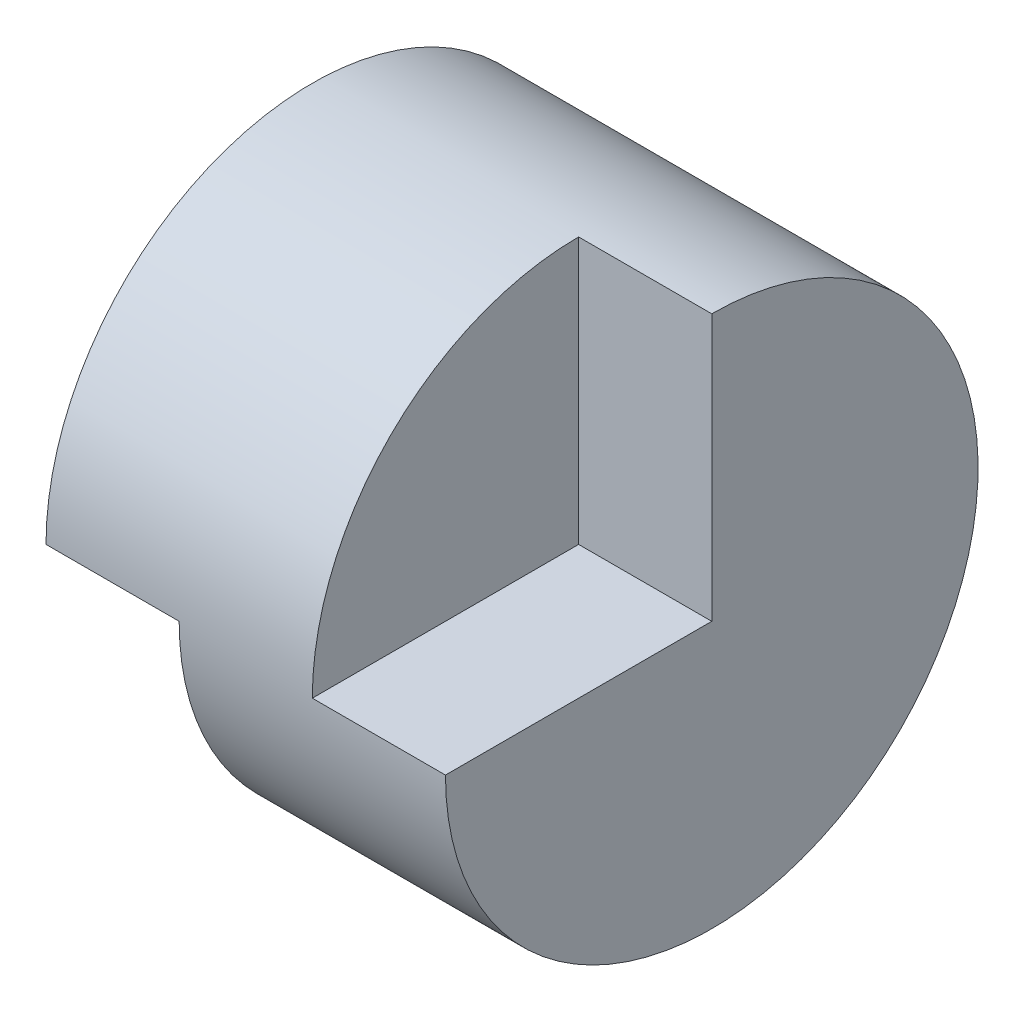
ISO-10303-21;
HEADER;
FILE_DESCRIPTION(('STEP AP214'),'2;1');
FILE_NAME('part.step','',(''),(''),'','','');
FILE_SCHEMA(('AUTOMOTIVE_DESIGN { 1 0 10303 214 1 1 1 1 }'));
ENDSEC;
DATA;
#1=APPLICATION_CONTEXT('core data for automotive mechanical design processes');
#2=APPLICATION_PROTOCOL_DEFINITION('international standard','automotive_design',2000,#1);
#3=PRODUCT_CONTEXT('',#1,'mechanical');
#4=PRODUCT('Part','Part','',(#3));
#5=PRODUCT_RELATED_PRODUCT_CATEGORY('part','',(#4));
#6=PRODUCT_DEFINITION_FORMATION('','',#4);
#7=PRODUCT_DEFINITION_CONTEXT('part definition',#1,'design');
#8=PRODUCT_DEFINITION('design','',#6,#7);
#9=PRODUCT_DEFINITION_SHAPE('','',#8);
#10=(LENGTH_UNIT() NAMED_UNIT(*) SI_UNIT(.MILLI.,.METRE.));
#11=(NAMED_UNIT(*) PLANE_ANGLE_UNIT() SI_UNIT($,.RADIAN.));
#12=(NAMED_UNIT(*) SI_UNIT($,.STERADIAN.) SOLID_ANGLE_UNIT());
#13=UNCERTAINTY_MEASURE_WITH_UNIT(LENGTH_MEASURE(1.E-05),#10,'distance_accuracy_value','');
#14=(GEOMETRIC_REPRESENTATION_CONTEXT(3) GLOBAL_UNCERTAINTY_ASSIGNED_CONTEXT((#13)) GLOBAL_UNIT_ASSIGNED_CONTEXT((#10,
#11,#12)) REPRESENTATION_CONTEXT('',''));
#15=CARTESIAN_POINT('',(0.,0.,0.));
#16=DIRECTION('',(0.,0.,1.));
#17=DIRECTION('',(1.,0.,0.));
#18=AXIS2_PLACEMENT_3D('',#15,#16,#17);
#19=CARTESIAN_POINT('',(40.,0.,40.));
#20=DIRECTION('',(-1.,0.,0.));
#21=DIRECTION('',(0.,0.,1.));
#22=AXIS2_PLACEMENT_3D('',#19,#20,#21);
#23=PLANE('',#22);
#24=CARTESIAN_POINT('',(40.,20.,20.));
#25=DIRECTION('',(-1.,0.,0.));
#26=DIRECTION('',(0.,0.,1.));
#27=AXIS2_PLACEMENT_3D('',#24,#25,#26);
#28=CIRCLE('',#27,20.);
#29=CARTESIAN_POINT('',(40.,40.,20.));
#30=VERTEX_POINT('',#29);
#31=CARTESIAN_POINT('',(40.,20.,40.));
#32=VERTEX_POINT('',#31);
#33=EDGE_CURVE('E181',#30,#32,#28,.T.);
#34=ORIENTED_EDGE('',*,*,#33,.F.);
#35=DIRECTION('',(0.,1.,0.));
#36=VECTOR('',#35,1.);
#37=CARTESIAN_POINT('',(40.,20.,20.));
#38=LINE('',#37,#36);
#39=CARTESIAN_POINT('',(40.,20.,20.));
#40=VERTEX_POINT('',#39);
#41=EDGE_CURVE('E159',#40,#30,#38,.T.);
#42=ORIENTED_EDGE('',*,*,#41,.F.);
#43=DIRECTION('',(0.,0.,-1.));
#44=VECTOR('',#43,1.);
#45=CARTESIAN_POINT('',(40.,20.,40.));
#46=LINE('',#45,#44);
#47=EDGE_CURVE('E162',#32,#40,#46,.T.);
#48=ORIENTED_EDGE('',*,*,#47,.F.);
#49=EDGE_LOOP('',(#34,#42,#48));
#50=FACE_BOUND('',#49,.T.);
#51=ADVANCED_FACE('F69',(#50),#23,.F.);
#52=CARTESIAN_POINT('',(10.,40.,0.));
#53=DIRECTION('',(1.,0.,0.));
#54=DIRECTION('',(0.,1.,0.));
#55=AXIS2_PLACEMENT_3D('',#52,#53,#54);
#56=PLANE('',#55);
#57=DIRECTION('',(0.,0.,1.));
#58=VECTOR('',#57,1.);
#59=CARTESIAN_POINT('',(10.,20.,0.));
#60=LINE('',#59,#58);
#61=CARTESIAN_POINT('',(10.,20.,0.));
#62=VERTEX_POINT('',#61);
#63=CARTESIAN_POINT('',(10.,20.,20.));
#64=VERTEX_POINT('',#63);
#65=EDGE_CURVE('E12',#62,#64,#60,.T.);
#66=ORIENTED_EDGE('',*,*,#65,.T.);
#67=DIRECTION('',(0.,0.,1.));
#68=VECTOR('',#67,1.);
#69=CARTESIAN_POINT('',(10.,20.,0.));
#70=LINE('',#69,#68);
#71=CARTESIAN_POINT('',(10.,20.,40.));
#72=VERTEX_POINT('',#71);
#73=EDGE_CURVE('E137',#64,#72,#70,.T.);
#74=ORIENTED_EDGE('',*,*,#73,.T.);
#75=CARTESIAN_POINT('',(10.,20.,20.));
#76=DIRECTION('',(-1.,0.,0.));
#77=DIRECTION('',(0.,-1.,0.));
#78=AXIS2_PLACEMENT_3D('',#75,#76,#77);
#79=CIRCLE('',#78,20.);
#80=EDGE_CURVE('E178',#72,#62,#79,.T.);
#81=ORIENTED_EDGE('',*,*,#80,.T.);
#82=EDGE_LOOP('',(#66,#74,#81));
#83=FACE_BOUND('',#82,.T.);
#84=ADVANCED_FACE('F199',(#83),#56,.F.);
#85=CARTESIAN_POINT('',(0.,0.,40.));
#86=DIRECTION('',(1.,0.,0.));
#87=DIRECTION('',(0.,0.,-1.));
#88=AXIS2_PLACEMENT_3D('',#85,#86,#87);
#89=PLANE('',#88);
#90=CARTESIAN_POINT('',(0.,20.,20.));
#91=DIRECTION('',(-1.,0.,0.));
#92=DIRECTION('',(0.,0.,1.));
#93=AXIS2_PLACEMENT_3D('',#90,#91,#92);
#94=CIRCLE('',#93,20.);
#95=CARTESIAN_POINT('',(0.,0.,20.));
#96=VERTEX_POINT('',#95);
#97=CARTESIAN_POINT('',(0.,20.,0.));
#98=VERTEX_POINT('',#97);
#99=EDGE_CURVE('E172',#96,#98,#94,.F.);
#100=ORIENTED_EDGE('',*,*,#99,.F.);
#101=DIRECTION('',(0.,-1.,0.));
#102=VECTOR('',#101,1.);
#103=CARTESIAN_POINT('',(0.,0.,20.));
#104=LINE('',#103,#102);
#105=CARTESIAN_POINT('',(0.,20.,20.));
#106=VERTEX_POINT('',#105);
#107=EDGE_CURVE('E150',#106,#96,#104,.T.);
#108=ORIENTED_EDGE('',*,*,#107,.F.);
#109=DIRECTION('',(0.,0.,1.));
#110=VECTOR('',#109,1.);
#111=CARTESIAN_POINT('',(0.,20.,0.));
#112=LINE('',#111,#110);
#113=EDGE_CURVE('E73',#98,#106,#112,.T.);
#114=ORIENTED_EDGE('',*,*,#113,.F.);
#115=EDGE_LOOP('',(#100,#108,#114));
#116=FACE_BOUND('',#115,.T.);
#117=ADVANCED_FACE('F71',(#116),#89,.F.);
#118=CARTESIAN_POINT('',(0.,20.,0.));
#119=DIRECTION('',(0.,-1.,0.));
#120=DIRECTION('',(0.,0.,-1.));
#121=AXIS2_PLACEMENT_3D('',#118,#119,#120);
#122=PLANE('',#121);
#123=ORIENTED_EDGE('',*,*,#113,.T.);
#124=DIRECTION('',(-1.,0.,0.));
#125=VECTOR('',#124,1.);
#126=CARTESIAN_POINT('',(20.,20.,20.));
#127=LINE('',#126,#125);
#128=EDGE_CURVE('E141',#64,#106,#127,.T.);
#129=ORIENTED_EDGE('',*,*,#128,.F.);
#130=ORIENTED_EDGE('',*,*,#65,.F.);
#131=DIRECTION('',(1.,0.,0.));
#132=VECTOR('',#131,1.);
#133=CARTESIAN_POINT('',(0.,20.,0.));
#134=LINE('',#133,#132);
#135=EDGE_CURVE('E184',#98,#62,#134,.T.);
#136=ORIENTED_EDGE('',*,*,#135,.F.);
#137=EDGE_LOOP('',(#123,#129,#130,#136));
#138=FACE_BOUND('',#137,.T.);
#139=ADVANCED_FACE('F191',(#138),#122,.F.);
#140=CARTESIAN_POINT('',(50.,20.,20.));
#141=DIRECTION('',(-1.,0.,0.));
#142=DIRECTION('',(0.,-1.,0.));
#143=AXIS2_PLACEMENT_3D('',#140,#141,#142);
#144=CYLINDRICAL_SURFACE('',#143,20.);
#145=DIRECTION('',(-1.,0.,0.));
#146=VECTOR('',#145,1.);
#147=CARTESIAN_POINT('',(20.,20.,40.));
#148=LINE('',#147,#146);
#149=CARTESIAN_POINT('',(20.,20.,40.));
#150=VERTEX_POINT('',#149);
#151=EDGE_CURVE('E155',#150,#72,#148,.T.);
#152=ORIENTED_EDGE('',*,*,#151,.F.);
#153=CARTESIAN_POINT('',(20.,20.,20.));
#154=DIRECTION('',(-1.,0.,0.));
#155=DIRECTION('',(0.,0.,-1.));
#156=AXIS2_PLACEMENT_3D('',#153,#154,#155);
#157=CIRCLE('',#156,20.);
#158=CARTESIAN_POINT('',(20.,0.,20.));
#159=VERTEX_POINT('',#158);
#160=EDGE_CURVE('E146',#159,#150,#157,.T.);
#161=ORIENTED_EDGE('',*,*,#160,.F.);
#162=DIRECTION('',(-1.,0.,0.));
#163=VECTOR('',#162,1.);
#164=CARTESIAN_POINT('',(20.,0.,20.));
#165=LINE('',#164,#163);
#166=EDGE_CURVE('E140',#159,#96,#165,.T.);
#167=ORIENTED_EDGE('',*,*,#166,.T.);
#168=ORIENTED_EDGE('',*,*,#99,.T.);
#169=ORIENTED_EDGE('',*,*,#135,.T.);
#170=ORIENTED_EDGE('',*,*,#80,.F.);
#171=EDGE_LOOP('',(#152,#161,#167,#168,#169,#170));
#172=FACE_BOUND('',#171,.T.);
#173=DIRECTION('',(1.,0.,0.));
#174=VECTOR('',#173,1.);
#175=CARTESIAN_POINT('',(30.,40.,20.));
#176=LINE('',#175,#174);
#177=CARTESIAN_POINT('',(30.,40.,20.));
#178=VERTEX_POINT('',#177);
#179=EDGE_CURVE('E166',#178,#30,#176,.T.);
#180=ORIENTED_EDGE('',*,*,#179,.T.);
#181=ORIENTED_EDGE('',*,*,#33,.T.);
#182=DIRECTION('',(1.,0.,0.));
#183=VECTOR('',#182,1.);
#184=CARTESIAN_POINT('',(30.,20.,40.));
#185=LINE('',#184,#183);
#186=CARTESIAN_POINT('',(30.,20.,40.));
#187=VERTEX_POINT('',#186);
#188=EDGE_CURVE('E173',#187,#32,#185,.T.);
#189=ORIENTED_EDGE('',*,*,#188,.F.);
#190=CARTESIAN_POINT('',(30.,20.,20.));
#191=DIRECTION('',(1.,0.,0.));
#192=DIRECTION('',(0.,0.,-1.));
#193=AXIS2_PLACEMENT_3D('',#190,#191,#192);
#194=CIRCLE('',#193,20.);
#195=EDGE_CURVE('E161',#178,#187,#194,.T.);
#196=ORIENTED_EDGE('',*,*,#195,.F.);
#197=EDGE_LOOP('',(#180,#181,#189,#196));
#198=FACE_BOUND('',#197,.T.);
#199=ADVANCED_FACE('F196',(#172,#198),#144,.T.);
#200=CARTESIAN_POINT('',(30.,20.,20.));
#201=DIRECTION('',(0.,0.,-1.));
#202=DIRECTION('',(-1.,0.,0.));
#203=AXIS2_PLACEMENT_3D('',#200,#201,#202);
#204=PLANE('',#203);
#205=ORIENTED_EDGE('',*,*,#41,.T.);
#206=ORIENTED_EDGE('',*,*,#179,.F.);
#207=DIRECTION('',(0.,1.,0.));
#208=VECTOR('',#207,1.);
#209=CARTESIAN_POINT('',(30.,20.,20.));
#210=LINE('',#209,#208);
#211=CARTESIAN_POINT('',(30.,20.,20.));
#212=VERTEX_POINT('',#211);
#213=EDGE_CURVE('E92',#212,#178,#210,.T.);
#214=ORIENTED_EDGE('',*,*,#213,.F.);
#215=DIRECTION('',(1.,0.,0.));
#216=VECTOR('',#215,1.);
#217=CARTESIAN_POINT('',(30.,20.,20.));
#218=LINE('',#217,#216);
#219=EDGE_CURVE('E170',#212,#40,#218,.T.);
#220=ORIENTED_EDGE('',*,*,#219,.T.);
#221=EDGE_LOOP('',(#205,#206,#214,#220));
#222=FACE_BOUND('',#221,.T.);
#223=ADVANCED_FACE('F214',(#222),#204,.F.);
#224=CARTESIAN_POINT('',(30.,20.,40.));
#225=DIRECTION('',(0.,-1.,0.));
#226=DIRECTION('',(0.,0.,-1.));
#227=AXIS2_PLACEMENT_3D('',#224,#225,#226);
#228=PLANE('',#227);
#229=ORIENTED_EDGE('',*,*,#47,.T.);
#230=ORIENTED_EDGE('',*,*,#219,.F.);
#231=DIRECTION('',(0.,0.,-1.));
#232=VECTOR('',#231,1.);
#233=CARTESIAN_POINT('',(30.,20.,40.));
#234=LINE('',#233,#232);
#235=EDGE_CURVE('E164',#187,#212,#234,.T.);
#236=ORIENTED_EDGE('',*,*,#235,.F.);
#237=ORIENTED_EDGE('',*,*,#188,.T.);
#238=EDGE_LOOP('',(#229,#230,#236,#237));
#239=FACE_BOUND('',#238,.T.);
#240=ADVANCED_FACE('F218',(#239),#228,.F.);
#241=CARTESIAN_POINT('',(30.,20.,20.));
#242=DIRECTION('',(1.,0.,0.));
#243=DIRECTION('',(0.,0.,-1.));
#244=AXIS2_PLACEMENT_3D('',#241,#242,#243);
#245=PLANE('',#244);
#246=ORIENTED_EDGE('',*,*,#213,.T.);
#247=ORIENTED_EDGE('',*,*,#195,.T.);
#248=ORIENTED_EDGE('',*,*,#235,.T.);
#249=EDGE_LOOP('',(#246,#247,#248));
#250=FACE_BOUND('',#249,.T.);
#251=ADVANCED_FACE('F223',(#250),#245,.T.);
#252=CARTESIAN_POINT('',(20.,20.,20.));
#253=DIRECTION('',(0.,1.,0.));
#254=DIRECTION('',(0.,0.,1.));
#255=AXIS2_PLACEMENT_3D('',#252,#253,#254);
#256=PLANE('',#255);
#257=CARTESIAN_POINT('',(20.,20.,20.));
#258=VERTEX_POINT('',#257);
#259=EDGE_CURVE('E133',#258,#64,#127,.T.);
#260=ORIENTED_EDGE('',*,*,#259,.F.);
#261=DIRECTION('',(0.,0.,-1.));
#262=VECTOR('',#261,1.);
#263=CARTESIAN_POINT('',(20.,20.,20.));
#264=LINE('',#263,#262);
#265=EDGE_CURVE('E135',#150,#258,#264,.T.);
#266=ORIENTED_EDGE('',*,*,#265,.F.);
#267=ORIENTED_EDGE('',*,*,#151,.T.);
#268=ORIENTED_EDGE('',*,*,#73,.F.);
#269=EDGE_LOOP('',(#260,#266,#267,#268));
#270=FACE_BOUND('',#269,.T.);
#271=ADVANCED_FACE('F134',(#270),#256,.F.);
#272=CARTESIAN_POINT('',(20.,0.,20.));
#273=DIRECTION('',(0.,0.,-1.));
#274=DIRECTION('',(-1.,0.,0.));
#275=AXIS2_PLACEMENT_3D('',#272,#273,#274);
#276=PLANE('',#275);
#277=ORIENTED_EDGE('',*,*,#107,.T.);
#278=ORIENTED_EDGE('',*,*,#166,.F.);
#279=DIRECTION('',(0.,-1.,0.));
#280=VECTOR('',#279,1.);
#281=CARTESIAN_POINT('',(20.,0.,20.));
#282=LINE('',#281,#280);
#283=EDGE_CURVE('E84',#258,#159,#282,.T.);
#284=ORIENTED_EDGE('',*,*,#283,.F.);
#285=ORIENTED_EDGE('',*,*,#259,.T.);
#286=ORIENTED_EDGE('',*,*,#128,.T.);
#287=EDGE_LOOP('',(#277,#278,#284,#285,#286));
#288=FACE_BOUND('',#287,.T.);
#289=ADVANCED_FACE('F143',(#288),#276,.F.);
#290=CARTESIAN_POINT('',(20.,20.,20.));
#291=DIRECTION('',(1.,0.,0.));
#292=DIRECTION('',(0.,0.,-1.));
#293=AXIS2_PLACEMENT_3D('',#290,#291,#292);
#294=PLANE('',#293);
#295=ORIENTED_EDGE('',*,*,#265,.T.);
#296=ORIENTED_EDGE('',*,*,#283,.T.);
#297=ORIENTED_EDGE('',*,*,#160,.T.);
#298=EDGE_LOOP('',(#295,#296,#297));
#299=FACE_BOUND('',#298,.T.);
#300=ADVANCED_FACE('F148',(#299),#294,.F.);
#301=CLOSED_SHELL('',(#51,#84,#117,#139,#199,#223,#240,#251,#271,#289,#300));
#302=MANIFOLD_SOLID_BREP('B2',#301);
#303=ADVANCED_BREP_SHAPE_REPRESENTATION('',(#18,#302),#14);
#304=SHAPE_DEFINITION_REPRESENTATION(#9,#303);
ENDSEC;
END-ISO-10303-21;
